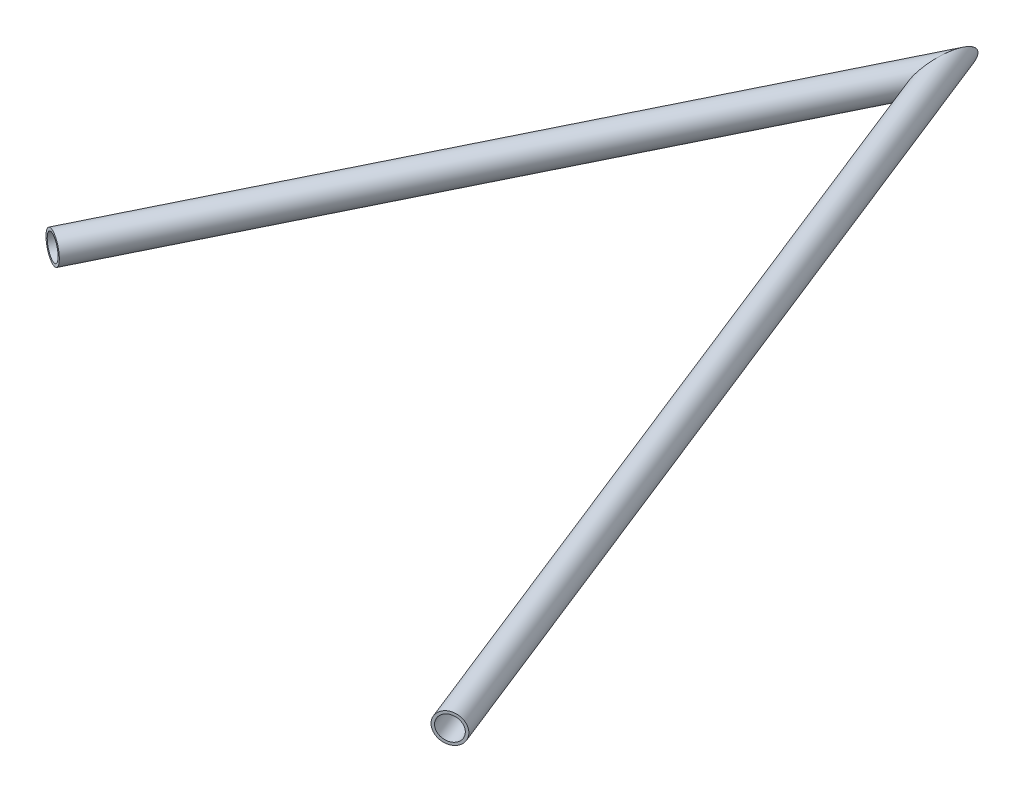
ISO-10303-21;
HEADER;
FILE_DESCRIPTION(('STEP AP214'),'2;1');
FILE_NAME('part.step','',(''),(''),'','','');
FILE_SCHEMA(('AUTOMOTIVE_DESIGN { 1 0 10303 214 1 1 1 1 }'));
ENDSEC;
DATA;
#1=APPLICATION_CONTEXT('core data for automotive mechanical design processes');
#2=APPLICATION_PROTOCOL_DEFINITION('international standard','automotive_design',2000,#1);
#3=PRODUCT_CONTEXT('',#1,'mechanical');
#4=PRODUCT('Part','Part','',(#3));
#5=PRODUCT_RELATED_PRODUCT_CATEGORY('part','',(#4));
#6=PRODUCT_DEFINITION_FORMATION('','',#4);
#7=PRODUCT_DEFINITION_CONTEXT('part definition',#1,'design');
#8=PRODUCT_DEFINITION('design','',#6,#7);
#9=PRODUCT_DEFINITION_SHAPE('','',#8);
#10=(LENGTH_UNIT() NAMED_UNIT(*) SI_UNIT(.MILLI.,.METRE.));
#11=(NAMED_UNIT(*) PLANE_ANGLE_UNIT() SI_UNIT($,.RADIAN.));
#12=(NAMED_UNIT(*) SI_UNIT($,.STERADIAN.) SOLID_ANGLE_UNIT());
#13=UNCERTAINTY_MEASURE_WITH_UNIT(LENGTH_MEASURE(1.E-05),#10,'distance_accuracy_value','');
#14=(GEOMETRIC_REPRESENTATION_CONTEXT(3) GLOBAL_UNCERTAINTY_ASSIGNED_CONTEXT((#13)) GLOBAL_UNIT_ASSIGNED_CONTEXT((#10,
#11,#12)) REPRESENTATION_CONTEXT('',''));
#15=CARTESIAN_POINT('',(0.,0.,0.));
#16=DIRECTION('',(0.,0.,1.));
#17=DIRECTION('',(1.,0.,0.));
#18=AXIS2_PLACEMENT_3D('',#15,#16,#17);
#19=CARTESIAN_POINT('',(0.,0.,0.));
#20=DIRECTION('',(0.368577334501348,0.,0.929597089330577));
#21=DIRECTION('',(0.929597089330577,0.,-0.368577334501348));
#22=AXIS2_PLACEMENT_3D('',#19,#20,#21);
#23=CYLINDRICAL_SURFACE('',#22,6.4643);
#24=CARTESIAN_POINT('',(175.642001202725,0.,442.990595998391));
#25=DIRECTION('',(-0.368577334501348,0.,-0.929597089330577));
#26=DIRECTION('',(-0.929597089330577,0.,0.368577334501348));
#27=AXIS2_PLACEMENT_3D('',#24,#25,#26);
#28=CIRCLE('',#27,6.4643);
#29=CARTESIAN_POINT('',(169.632806738165,0.,445.373190461808));
#30=VERTEX_POINT('',#29);
#31=EDGE_CURVE('E53',#30,#30,#28,.T.);
#32=ORIENTED_EDGE('',*,*,#31,.F.);
#33=EDGE_LOOP('',(#32));
#34=FACE_BOUND('',#33,.T.);
#35=CARTESIAN_POINT('',(0.,0.,0.));
#36=DIRECTION('',(-0.999213286759932,0.,-0.0396586379293767));
#37=DIRECTION('',(-0.0396586379293767,0.,0.999213286759932));
#38=AXIS2_PLACEMENT_3D('',#35,#36,#37);
#39=ELLIPSE('',#38,15.9551706489641,6.4643);
#40=CARTESIAN_POINT('',(-0.632760335868688,0.,15.9426185049671));
#41=VERTEX_POINT('',#40);
#42=EDGE_CURVE('E49',#41,#41,#39,.T.);
#43=ORIENTED_EDGE('',*,*,#42,.T.);
#44=EDGE_LOOP('',(#43));
#45=FACE_BOUND('',#44,.T.);
#46=ADVANCED_FACE('F45',(#34,#45),#23,.F.);
#47=CARTESIAN_POINT('',(0.,0.,0.));
#48=DIRECTION('',(0.368577334501348,0.,0.929597089330577));
#49=DIRECTION('',(0.929597089330577,0.,-0.368577334501348));
#50=AXIS2_PLACEMENT_3D('',#47,#48,#49);
#51=CYLINDRICAL_SURFACE('',#50,7.9375);
#52=CARTESIAN_POINT('',(175.642001202725,0.,442.990595998391));
#53=DIRECTION('',(-0.368577334501348,0.,-0.929597089330577));
#54=DIRECTION('',(-0.929597089330577,0.,0.368577334501348));
#55=AXIS2_PLACEMENT_3D('',#52,#53,#54);
#56=CIRCLE('',#55,7.9375);
#57=CARTESIAN_POINT('',(168.263324306163,0.,445.916178590995));
#58=VERTEX_POINT('',#57);
#59=EDGE_CURVE('E57',#58,#58,#56,.T.);
#60=ORIENTED_EDGE('',*,*,#59,.T.);
#61=EDGE_LOOP('',(#60));
#62=FACE_BOUND('',#61,.T.);
#63=CARTESIAN_POINT('',(0.,0.,0.));
#64=DIRECTION('',(-0.999213286759932,0.,-0.0396586379293767));
#65=DIRECTION('',(-0.0396586379293767,0.,0.999213286759932));
#66=AXIS2_PLACEMENT_3D('',#63,#64,#65);
#67=ELLIPSE('',#66,19.5913195591406,7.9375);
#68=CARTESIAN_POINT('',(-0.776965048954676,0.,19.5759068086531));
#69=VERTEX_POINT('',#68);
#70=EDGE_CURVE('E12',#69,#69,#67,.T.);
#71=ORIENTED_EDGE('',*,*,#70,.F.);
#72=EDGE_LOOP('',(#71));
#73=FACE_BOUND('',#72,.T.);
#74=ADVANCED_FACE('F72',(#62,#73),#51,.T.);
#75=CARTESIAN_POINT('',(175.642001202725,0.,442.990595998391));
#76=DIRECTION('',(-0.368577334501348,0.,-0.929597089330577));
#77=DIRECTION('',(-0.929597089330577,0.,0.368577334501348));
#78=AXIS2_PLACEMENT_3D('',#75,#76,#77);
#79=PLANE('',#78);
#80=ORIENTED_EDGE('',*,*,#31,.T.);
#81=EDGE_LOOP('',(#80));
#82=FACE_BOUND('',#81,.T.);
#83=ORIENTED_EDGE('',*,*,#59,.F.);
#84=EDGE_LOOP('',(#83));
#85=FACE_BOUND('',#84,.T.);
#86=ADVANCED_FACE('F68',(#82,#85),#79,.F.);
#87=CARTESIAN_POINT('',(0.,0.,0.));
#88=DIRECTION('',(-0.999213286759932,0.,-0.0396586379293767));
#89=DIRECTION('',(-0.0396586379293767,0.,0.999213286759932));
#90=AXIS2_PLACEMENT_3D('',#87,#88,#89);
#91=PLANE('',#90);
#92=ORIENTED_EDGE('',*,*,#42,.F.);
#93=EDGE_LOOP('',(#92));
#94=FACE_BOUND('',#93,.T.);
#95=ORIENTED_EDGE('',*,*,#70,.T.);
#96=EDGE_LOOP('',(#95));
#97=FACE_BOUND('',#96,.T.);
#98=ADVANCED_FACE('F47',(#94,#97),#91,.T.);
#99=CLOSED_SHELL('',(#46,#74,#86,#98));
#100=MANIFOLD_SOLID_BREP('B2',#99);
#101=CARTESIAN_POINT('',(-159.427980512296,0.,324.377047389716));
#102=DIRECTION('',(0.441093034022298,0.,-0.8974613837581));
#103=DIRECTION('',(-0.8974613837581,0.,-0.441093034022298));
#104=AXIS2_PLACEMENT_3D('',#101,#102,#103);
#105=CYLINDRICAL_SURFACE('',#104,6.4643);
#106=CARTESIAN_POINT('',(-159.427980512296,0.,324.377047389716));
#107=DIRECTION('',(-0.441093034022298,0.,0.8974613837581));
#108=DIRECTION('',(0.8974613837581,0.,0.441093034022298));
#109=AXIS2_PLACEMENT_3D('',#106,#107,#108);
#110=CIRCLE('',#109,6.4643);
#111=CARTESIAN_POINT('',(-153.626520889268,0.,327.228405089547));
#112=VERTEX_POINT('',#111);
#113=EDGE_CURVE('E141',#112,#112,#110,.T.);
#114=ORIENTED_EDGE('',*,*,#113,.T.);
#115=EDGE_LOOP('',(#114));
#116=FACE_BOUND('',#115,.T.);
#117=CARTESIAN_POINT('',(0.,0.,0.));
#118=DIRECTION('',(0.999213286759932,0.,0.0396586379293768));
#119=DIRECTION('',(0.0396586379293768,0.,-0.999213286759932));
#120=AXIS2_PLACEMENT_3D('',#117,#118,#119);
#121=ELLIPSE('',#120,15.9551706489642,6.4643);
#122=CARTESIAN_POINT('',(0.632760335868662,0.,-15.942618504967));
#123=VERTEX_POINT('',#122);
#124=EDGE_CURVE('E131',#123,#123,#121,.T.);
#125=ORIENTED_EDGE('',*,*,#124,.T.);
#126=EDGE_LOOP('',(#125));
#127=FACE_BOUND('',#126,.T.);
#128=ADVANCED_FACE('F127',(#116,#127),#105,.F.);
#129=CARTESIAN_POINT('',(-159.427980512296,0.,324.377047389716));
#130=DIRECTION('',(0.441093034022298,0.,-0.8974613837581));
#131=DIRECTION('',(-0.8974613837581,0.,-0.441093034022298));
#132=AXIS2_PLACEMENT_3D('',#129,#130,#131);
#133=CYLINDRICAL_SURFACE('',#132,7.9375);
#134=CARTESIAN_POINT('',(-159.427980512296,0.,324.377047389716));
#135=DIRECTION('',(-0.441093034022298,0.,0.8974613837581));
#136=DIRECTION('',(0.8974613837581,0.,0.441093034022298));
#137=AXIS2_PLACEMENT_3D('',#134,#135,#136);
#138=CIRCLE('',#137,7.9375);
#139=CARTESIAN_POINT('',(-152.304380778716,0.,327.878223347268));
#140=VERTEX_POINT('',#139);
#141=EDGE_CURVE('E135',#140,#140,#138,.T.);
#142=ORIENTED_EDGE('',*,*,#141,.F.);
#143=EDGE_LOOP('',(#142));
#144=FACE_BOUND('',#143,.T.);
#145=CARTESIAN_POINT('',(0.,0.,0.));
#146=DIRECTION('',(0.999213286759932,0.,0.0396586379293768));
#147=DIRECTION('',(0.0396586379293768,0.,-0.999213286759932));
#148=AXIS2_PLACEMENT_3D('',#145,#146,#147);
#149=ELLIPSE('',#148,19.5913195591407,7.9375);
#150=CARTESIAN_POINT('',(0.776965048954651,0.,-19.575906808653));
#151=VERTEX_POINT('',#150);
#152=EDGE_CURVE('E44',#151,#151,#149,.T.);
#153=ORIENTED_EDGE('',*,*,#152,.F.);
#154=EDGE_LOOP('',(#153));
#155=FACE_BOUND('',#154,.T.);
#156=ADVANCED_FACE('F154',(#144,#155),#133,.T.);
#157=CARTESIAN_POINT('',(-159.427980512296,0.,324.377047389716));
#158=DIRECTION('',(-0.441093034022298,0.,0.8974613837581));
#159=DIRECTION('',(0.8974613837581,0.,0.441093034022298));
#160=AXIS2_PLACEMENT_3D('',#157,#158,#159);
#161=PLANE('',#160);
#162=ORIENTED_EDGE('',*,*,#113,.F.);
#163=EDGE_LOOP('',(#162));
#164=FACE_BOUND('',#163,.T.);
#165=ORIENTED_EDGE('',*,*,#141,.T.);
#166=EDGE_LOOP('',(#165));
#167=FACE_BOUND('',#166,.T.);
#168=ADVANCED_FACE('F150',(#164,#167),#161,.T.);
#169=CARTESIAN_POINT('',(0.,0.,0.));
#170=DIRECTION('',(0.999213286759932,0.,0.0396586379293768));
#171=DIRECTION('',(0.0396586379293768,0.,-0.999213286759932));
#172=AXIS2_PLACEMENT_3D('',#169,#170,#171);
#173=PLANE('',#172);
#174=ORIENTED_EDGE('',*,*,#124,.F.);
#175=EDGE_LOOP('',(#174));
#176=FACE_BOUND('',#175,.T.);
#177=ORIENTED_EDGE('',*,*,#152,.T.);
#178=EDGE_LOOP('',(#177));
#179=FACE_BOUND('',#178,.T.);
#180=ADVANCED_FACE('F129',(#176,#179),#173,.T.);
#181=CLOSED_SHELL('',(#128,#156,#168,#180));
#182=MANIFOLD_SOLID_BREP('B7',#181);
#183=ADVANCED_BREP_SHAPE_REPRESENTATION('',(#18,#100,#182),#14);
#184=SHAPE_DEFINITION_REPRESENTATION(#9,#183);
ENDSEC;
END-ISO-10303-21;
